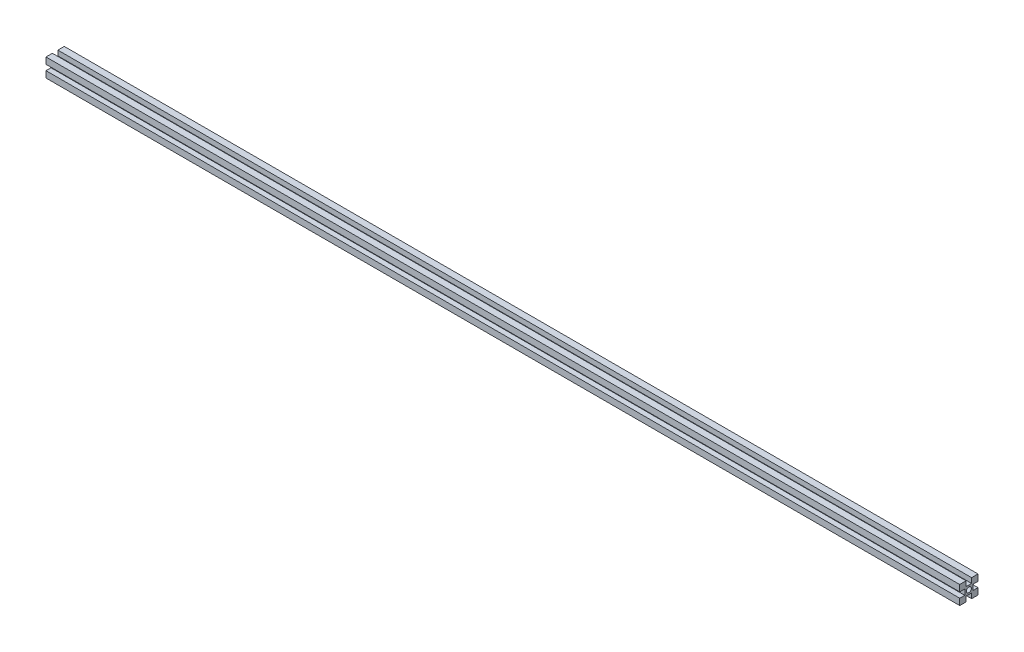
ISO-10303-21;
HEADER;
FILE_DESCRIPTION(('STEP AP214'),'2;1');
FILE_NAME('part.step','',(''),(''),'','','');
FILE_SCHEMA(('AUTOMOTIVE_DESIGN { 1 0 10303 214 1 1 1 1 }'));
ENDSEC;
DATA;
#1=APPLICATION_CONTEXT('core data for automotive mechanical design processes');
#2=APPLICATION_PROTOCOL_DEFINITION('international standard','automotive_design',2000,#1);
#3=PRODUCT_CONTEXT('',#1,'mechanical');
#4=PRODUCT('Part','Part','',(#3));
#5=PRODUCT_RELATED_PRODUCT_CATEGORY('part','',(#4));
#6=PRODUCT_DEFINITION_FORMATION('','',#4);
#7=PRODUCT_DEFINITION_CONTEXT('part definition',#1,'design');
#8=PRODUCT_DEFINITION('design','',#6,#7);
#9=PRODUCT_DEFINITION_SHAPE('','',#8);
#10=(LENGTH_UNIT() NAMED_UNIT(*) SI_UNIT(.MILLI.,.METRE.));
#11=(NAMED_UNIT(*) PLANE_ANGLE_UNIT() SI_UNIT($,.RADIAN.));
#12=(NAMED_UNIT(*) SI_UNIT($,.STERADIAN.) SOLID_ANGLE_UNIT());
#13=UNCERTAINTY_MEASURE_WITH_UNIT(LENGTH_MEASURE(1.E-05),#10,'distance_accuracy_value','');
#14=(GEOMETRIC_REPRESENTATION_CONTEXT(3) GLOBAL_UNCERTAINTY_ASSIGNED_CONTEXT((#13)) GLOBAL_UNIT_ASSIGNED_CONTEXT((#10,
#11,#12)) REPRESENTATION_CONTEXT('',''));
#15=CARTESIAN_POINT('',(0.,0.,0.));
#16=DIRECTION('',(0.,0.,1.));
#17=DIRECTION('',(1.,0.,0.));
#18=AXIS2_PLACEMENT_3D('',#15,#16,#17);
#19=CARTESIAN_POINT('',(0.,0.,0.));
#20=DIRECTION('',(1.,0.,0.));
#21=DIRECTION('',(0.,0.,-1.));
#22=AXIS2_PLACEMENT_3D('',#19,#20,#21);
#23=PLANE('',#22);
#24=DIRECTION('',(0.,0.,1.));
#25=VECTOR('',#24,1.);
#26=CARTESIAN_POINT('',(0.,3.,-10.));
#27=LINE('',#26,#25);
#28=CARTESIAN_POINT('',(0.,3.,-10.));
#29=VERTEX_POINT('',#28);
#30=CARTESIAN_POINT('',(0.,3.,-4.5));
#31=VERTEX_POINT('',#30);
#32=EDGE_CURVE('E9',#29,#31,#27,.T.);
#33=ORIENTED_EDGE('',*,*,#32,.T.);
#34=DIRECTION('',(0.,-1.,0.));
#35=VECTOR('',#34,1.);
#36=CARTESIAN_POINT('',(0.,3.,-4.5));
#37=LINE('',#36,#35);
#38=CARTESIAN_POINT('',(0.,-3.,-4.5));
#39=VERTEX_POINT('',#38);
#40=EDGE_CURVE('E224',#31,#39,#37,.T.);
#41=ORIENTED_EDGE('',*,*,#40,.T.);
#42=DIRECTION('',(0.,0.,-1.));
#43=VECTOR('',#42,1.);
#44=CARTESIAN_POINT('',(0.,-3.,-4.5));
#45=LINE('',#44,#43);
#46=CARTESIAN_POINT('',(0.,-3.,-10.));
#47=VERTEX_POINT('',#46);
#48=EDGE_CURVE('E208',#39,#47,#45,.T.);
#49=ORIENTED_EDGE('',*,*,#48,.T.);
#50=DIRECTION('',(0.,-1.,0.));
#51=VECTOR('',#50,1.);
#52=CARTESIAN_POINT('',(0.,-3.,-10.));
#53=LINE('',#52,#51);
#54=CARTESIAN_POINT('',(0.,-10.,-10.));
#55=VERTEX_POINT('',#54);
#56=EDGE_CURVE('E279',#47,#55,#53,.T.);
#57=ORIENTED_EDGE('',*,*,#56,.T.);
#58=DIRECTION('',(0.,0.,1.));
#59=VECTOR('',#58,1.);
#60=CARTESIAN_POINT('',(0.,-10.,-10.));
#61=LINE('',#60,#59);
#62=CARTESIAN_POINT('',(0.,-10.,-3.));
#63=VERTEX_POINT('',#62);
#64=EDGE_CURVE('E186',#55,#63,#61,.T.);
#65=ORIENTED_EDGE('',*,*,#64,.T.);
#66=DIRECTION('',(0.,1.,0.));
#67=VECTOR('',#66,1.);
#68=CARTESIAN_POINT('',(0.,-10.,-3.));
#69=LINE('',#68,#67);
#70=CARTESIAN_POINT('',(0.,-4.5,-3.));
#71=VERTEX_POINT('',#70);
#72=EDGE_CURVE('E194',#63,#71,#69,.T.);
#73=ORIENTED_EDGE('',*,*,#72,.T.);
#74=DIRECTION('',(0.,0.,1.));
#75=VECTOR('',#74,1.);
#76=CARTESIAN_POINT('',(0.,-4.5,-3.));
#77=LINE('',#76,#75);
#78=CARTESIAN_POINT('',(0.,-4.5,3.));
#79=VERTEX_POINT('',#78);
#80=EDGE_CURVE('E244',#71,#79,#77,.T.);
#81=ORIENTED_EDGE('',*,*,#80,.T.);
#82=DIRECTION('',(0.,-1.,0.));
#83=VECTOR('',#82,1.);
#84=CARTESIAN_POINT('',(0.,-4.5,3.));
#85=LINE('',#84,#83);
#86=CARTESIAN_POINT('',(0.,-10.,3.));
#87=VERTEX_POINT('',#86);
#88=EDGE_CURVE('E250',#79,#87,#85,.T.);
#89=ORIENTED_EDGE('',*,*,#88,.T.);
#90=DIRECTION('',(0.,0.,1.));
#91=VECTOR('',#90,1.);
#92=CARTESIAN_POINT('',(0.,-10.,3.));
#93=LINE('',#92,#91);
#94=CARTESIAN_POINT('',(0.,-10.,10.));
#95=VERTEX_POINT('',#94);
#96=EDGE_CURVE('E206',#87,#95,#93,.T.);
#97=ORIENTED_EDGE('',*,*,#96,.T.);
#98=DIRECTION('',(0.,1.,0.));
#99=VECTOR('',#98,1.);
#100=CARTESIAN_POINT('',(0.,-10.,10.));
#101=LINE('',#100,#99);
#102=CARTESIAN_POINT('',(0.,-3.,10.));
#103=VERTEX_POINT('',#102);
#104=EDGE_CURVE('E232',#95,#103,#101,.T.);
#105=ORIENTED_EDGE('',*,*,#104,.T.);
#106=DIRECTION('',(0.,0.,-1.));
#107=VECTOR('',#106,1.);
#108=CARTESIAN_POINT('',(0.,-3.,10.));
#109=LINE('',#108,#107);
#110=CARTESIAN_POINT('',(0.,-3.,4.5));
#111=VERTEX_POINT('',#110);
#112=EDGE_CURVE('E170',#103,#111,#109,.T.);
#113=ORIENTED_EDGE('',*,*,#112,.T.);
#114=DIRECTION('',(0.,1.,0.));
#115=VECTOR('',#114,1.);
#116=CARTESIAN_POINT('',(0.,-3.,4.5));
#117=LINE('',#116,#115);
#118=CARTESIAN_POINT('',(0.,3.,4.5));
#119=VERTEX_POINT('',#118);
#120=EDGE_CURVE('E156',#111,#119,#117,.T.);
#121=ORIENTED_EDGE('',*,*,#120,.T.);
#122=DIRECTION('',(0.,0.,1.));
#123=VECTOR('',#122,1.);
#124=CARTESIAN_POINT('',(0.,3.,4.5));
#125=LINE('',#124,#123);
#126=CARTESIAN_POINT('',(0.,3.,10.));
#127=VERTEX_POINT('',#126);
#128=EDGE_CURVE('E162',#119,#127,#125,.T.);
#129=ORIENTED_EDGE('',*,*,#128,.T.);
#130=DIRECTION('',(0.,1.,0.));
#131=VECTOR('',#130,1.);
#132=CARTESIAN_POINT('',(0.,3.,10.));
#133=LINE('',#132,#131);
#134=CARTESIAN_POINT('',(0.,10.,10.));
#135=VERTEX_POINT('',#134);
#136=EDGE_CURVE('E219',#127,#135,#133,.T.);
#137=ORIENTED_EDGE('',*,*,#136,.T.);
#138=DIRECTION('',(0.,0.,-1.));
#139=VECTOR('',#138,1.);
#140=CARTESIAN_POINT('',(0.,10.,10.));
#141=LINE('',#140,#139);
#142=CARTESIAN_POINT('',(0.,10.,3.));
#143=VERTEX_POINT('',#142);
#144=EDGE_CURVE('E273',#135,#143,#141,.T.);
#145=ORIENTED_EDGE('',*,*,#144,.T.);
#146=DIRECTION('',(0.,-1.,0.));
#147=VECTOR('',#146,1.);
#148=CARTESIAN_POINT('',(0.,10.,3.));
#149=LINE('',#148,#147);
#150=CARTESIAN_POINT('',(0.,4.5,3.));
#151=VERTEX_POINT('',#150);
#152=EDGE_CURVE('E181',#143,#151,#149,.T.);
#153=ORIENTED_EDGE('',*,*,#152,.T.);
#154=DIRECTION('',(0.,0.,-1.));
#155=VECTOR('',#154,1.);
#156=CARTESIAN_POINT('',(0.,4.5,3.));
#157=LINE('',#156,#155);
#158=CARTESIAN_POINT('',(0.,4.5,-3.));
#159=VERTEX_POINT('',#158);
#160=EDGE_CURVE('E268',#151,#159,#157,.T.);
#161=ORIENTED_EDGE('',*,*,#160,.T.);
#162=DIRECTION('',(0.,1.,0.));
#163=VECTOR('',#162,1.);
#164=CARTESIAN_POINT('',(0.,4.5,-3.));
#165=LINE('',#164,#163);
#166=CARTESIAN_POINT('',(0.,10.,-3.));
#167=VERTEX_POINT('',#166);
#168=EDGE_CURVE('E240',#159,#167,#165,.T.);
#169=ORIENTED_EDGE('',*,*,#168,.T.);
#170=DIRECTION('',(0.,0.,-1.));
#171=VECTOR('',#170,1.);
#172=CARTESIAN_POINT('',(0.,10.,-3.));
#173=LINE('',#172,#171);
#174=CARTESIAN_POINT('',(0.,10.,-10.));
#175=VERTEX_POINT('',#174);
#176=EDGE_CURVE('E263',#167,#175,#173,.T.);
#177=ORIENTED_EDGE('',*,*,#176,.T.);
#178=DIRECTION('',(0.,-1.,0.));
#179=VECTOR('',#178,1.);
#180=CARTESIAN_POINT('',(0.,10.,-10.));
#181=LINE('',#180,#179);
#182=EDGE_CURVE('E124',#175,#29,#181,.T.);
#183=ORIENTED_EDGE('',*,*,#182,.T.);
#184=EDGE_LOOP('',(#33,#41,#49,#57,#65,#73,#81,#89,#97,#105,#113,#121,#129,#137,#145,#153,#161,
#169,#177,#183));
#185=FACE_BOUND('',#184,.T.);
#186=CARTESIAN_POINT('',(0.,0.,0.));
#187=DIRECTION('',(1.,0.,0.));
#188=DIRECTION('',(0.,0.,-1.));
#189=AXIS2_PLACEMENT_3D('',#186,#187,#188);
#190=CIRCLE('',#189,2.75);
#191=CARTESIAN_POINT('',(0.,0.,-2.75));
#192=VERTEX_POINT('',#191);
#193=EDGE_CURVE('E193',#192,#192,#190,.T.);
#194=ORIENTED_EDGE('',*,*,#193,.T.);
#195=EDGE_LOOP('',(#194));
#196=FACE_BOUND('',#195,.T.);
#197=ADVANCED_FACE('F15',(#185,#196),#23,.F.);
#198=CARTESIAN_POINT('',(1000.,0.,0.));
#199=DIRECTION('',(1.,0.,0.));
#200=DIRECTION('',(0.,0.,-1.));
#201=AXIS2_PLACEMENT_3D('',#198,#199,#200);
#202=PLANE('',#201);
#203=DIRECTION('',(0.,-1.,0.));
#204=VECTOR('',#203,1.);
#205=CARTESIAN_POINT('',(1000.,3.,-4.49999999999994));
#206=LINE('',#205,#204);
#207=CARTESIAN_POINT('',(1000.,3.,-4.49999999999994));
#208=VERTEX_POINT('',#207);
#209=CARTESIAN_POINT('',(1000.,-3.,-4.49999999999994));
#210=VERTEX_POINT('',#209);
#211=EDGE_CURVE('E192',#208,#210,#206,.T.);
#212=ORIENTED_EDGE('',*,*,#211,.F.);
#213=DIRECTION('',(0.,0.,1.));
#214=VECTOR('',#213,1.);
#215=CARTESIAN_POINT('',(1000.,3.,-10.));
#216=LINE('',#215,#214);
#217=CARTESIAN_POINT('',(1000.,3.,-10.));
#218=VERTEX_POINT('',#217);
#219=EDGE_CURVE('E25',#218,#208,#216,.T.);
#220=ORIENTED_EDGE('',*,*,#219,.F.);
#221=DIRECTION('',(0.,-1.,0.));
#222=VECTOR('',#221,1.);
#223=CARTESIAN_POINT('',(1000.,10.,-10.));
#224=LINE('',#223,#222);
#225=CARTESIAN_POINT('',(1000.,10.,-10.));
#226=VERTEX_POINT('',#225);
#227=EDGE_CURVE('E131',#226,#218,#224,.T.);
#228=ORIENTED_EDGE('',*,*,#227,.F.);
#229=DIRECTION('',(0.,0.,-1.));
#230=VECTOR('',#229,1.);
#231=CARTESIAN_POINT('',(1000.,10.,-2.99999999999994));
#232=LINE('',#231,#230);
#233=CARTESIAN_POINT('',(1000.,10.,-2.99999999999994));
#234=VERTEX_POINT('',#233);
#235=EDGE_CURVE('E237',#234,#226,#232,.T.);
#236=ORIENTED_EDGE('',*,*,#235,.F.);
#237=DIRECTION('',(0.,1.,0.));
#238=VECTOR('',#237,1.);
#239=CARTESIAN_POINT('',(1000.,4.5,-2.99999999999994));
#240=LINE('',#239,#238);
#241=CARTESIAN_POINT('',(1000.,4.5,-2.99999999999994));
#242=VERTEX_POINT('',#241);
#243=EDGE_CURVE('E264',#242,#234,#240,.T.);
#244=ORIENTED_EDGE('',*,*,#243,.F.);
#245=DIRECTION('',(0.,0.,-1.));
#246=VECTOR('',#245,1.);
#247=CARTESIAN_POINT('',(1000.,4.5,3.00000000000006));
#248=LINE('',#247,#246);
#249=CARTESIAN_POINT('',(1000.,4.5,3.00000000000006));
#250=VERTEX_POINT('',#249);
#251=EDGE_CURVE('E177',#250,#242,#248,.T.);
#252=ORIENTED_EDGE('',*,*,#251,.F.);
#253=DIRECTION('',(0.,-1.,0.));
#254=VECTOR('',#253,1.);
#255=CARTESIAN_POINT('',(1000.,10.,3.00000000000006));
#256=LINE('',#255,#254);
#257=CARTESIAN_POINT('',(1000.,10.,3.00000000000006));
#258=VERTEX_POINT('',#257);
#259=EDGE_CURVE('E257',#258,#250,#256,.T.);
#260=ORIENTED_EDGE('',*,*,#259,.F.);
#261=DIRECTION('',(0.,0.,-1.));
#262=VECTOR('',#261,1.);
#263=CARTESIAN_POINT('',(1000.,10.,10.));
#264=LINE('',#263,#262);
#265=CARTESIAN_POINT('',(1000.,10.,10.));
#266=VERTEX_POINT('',#265);
#267=EDGE_CURVE('E233',#266,#258,#264,.T.);
#268=ORIENTED_EDGE('',*,*,#267,.F.);
#269=DIRECTION('',(0.,1.,0.));
#270=VECTOR('',#269,1.);
#271=CARTESIAN_POINT('',(1000.,3.,10.));
#272=LINE('',#271,#270);
#273=CARTESIAN_POINT('',(1000.,3.,10.));
#274=VERTEX_POINT('',#273);
#275=EDGE_CURVE('E151',#274,#266,#272,.T.);
#276=ORIENTED_EDGE('',*,*,#275,.F.);
#277=DIRECTION('',(0.,0.,1.));
#278=VECTOR('',#277,1.);
#279=CARTESIAN_POINT('',(1000.,3.,4.50000000000006));
#280=LINE('',#279,#278);
#281=CARTESIAN_POINT('',(1000.,3.,4.50000000000006));
#282=VERTEX_POINT('',#281);
#283=EDGE_CURVE('E140',#282,#274,#280,.T.);
#284=ORIENTED_EDGE('',*,*,#283,.F.);
#285=DIRECTION('',(0.,1.,0.));
#286=VECTOR('',#285,1.);
#287=CARTESIAN_POINT('',(1000.,-3.,4.50000000000006));
#288=LINE('',#287,#286);
#289=CARTESIAN_POINT('',(1000.,-3.,4.50000000000006));
#290=VERTEX_POINT('',#289);
#291=EDGE_CURVE('E147',#290,#282,#288,.T.);
#292=ORIENTED_EDGE('',*,*,#291,.F.);
#293=DIRECTION('',(0.,0.,-1.));
#294=VECTOR('',#293,1.);
#295=CARTESIAN_POINT('',(1000.,-3.,10.));
#296=LINE('',#295,#294);
#297=CARTESIAN_POINT('',(1000.,-3.,10.));
#298=VERTEX_POINT('',#297);
#299=EDGE_CURVE('E188',#298,#290,#296,.T.);
#300=ORIENTED_EDGE('',*,*,#299,.F.);
#301=DIRECTION('',(0.,1.,0.));
#302=VECTOR('',#301,1.);
#303=CARTESIAN_POINT('',(1000.,-10.,10.));
#304=LINE('',#303,#302);
#305=CARTESIAN_POINT('',(1000.,-10.,10.));
#306=VERTEX_POINT('',#305);
#307=EDGE_CURVE('E214',#306,#298,#304,.T.);
#308=ORIENTED_EDGE('',*,*,#307,.F.);
#309=DIRECTION('',(0.,0.,1.));
#310=VECTOR('',#309,1.);
#311=CARTESIAN_POINT('',(1000.,-10.,3.00000000000006));
#312=LINE('',#311,#310);
#313=CARTESIAN_POINT('',(1000.,-10.,3.00000000000006));
#314=VERTEX_POINT('',#313);
#315=EDGE_CURVE('E207',#314,#306,#312,.T.);
#316=ORIENTED_EDGE('',*,*,#315,.F.);
#317=DIRECTION('',(0.,-1.,0.));
#318=VECTOR('',#317,1.);
#319=CARTESIAN_POINT('',(1000.,-4.5,3.00000000000006));
#320=LINE('',#319,#318);
#321=CARTESIAN_POINT('',(1000.,-4.5,3.00000000000006));
#322=VERTEX_POINT('',#321);
#323=EDGE_CURVE('E247',#322,#314,#320,.T.);
#324=ORIENTED_EDGE('',*,*,#323,.F.);
#325=DIRECTION('',(0.,0.,1.));
#326=VECTOR('',#325,1.);
#327=CARTESIAN_POINT('',(1000.,-4.5,-2.99999999999994));
#328=LINE('',#327,#326);
#329=CARTESIAN_POINT('',(1000.,-4.5,-2.99999999999994));
#330=VERTEX_POINT('',#329);
#331=EDGE_CURVE('E197',#330,#322,#328,.T.);
#332=ORIENTED_EDGE('',*,*,#331,.F.);
#333=DIRECTION('',(0.,1.,0.));
#334=VECTOR('',#333,1.);
#335=CARTESIAN_POINT('',(1000.,-10.,-2.99999999999994));
#336=LINE('',#335,#334);
#337=CARTESIAN_POINT('',(1000.,-10.,-2.99999999999994));
#338=VERTEX_POINT('',#337);
#339=EDGE_CURVE('E182',#338,#330,#336,.T.);
#340=ORIENTED_EDGE('',*,*,#339,.F.);
#341=DIRECTION('',(0.,0.,1.));
#342=VECTOR('',#341,1.);
#343=CARTESIAN_POINT('',(1000.,-10.,-10.));
#344=LINE('',#343,#342);
#345=CARTESIAN_POINT('',(1000.,-10.,-10.));
#346=VERTEX_POINT('',#345);
#347=EDGE_CURVE('E282',#346,#338,#344,.T.);
#348=ORIENTED_EDGE('',*,*,#347,.F.);
#349=DIRECTION('',(0.,-1.,0.));
#350=VECTOR('',#349,1.);
#351=CARTESIAN_POINT('',(1000.,-3.,-10.));
#352=LINE('',#351,#350);
#353=CARTESIAN_POINT('',(1000.,-3.,-10.));
#354=VERTEX_POINT('',#353);
#355=EDGE_CURVE('E211',#354,#346,#352,.T.);
#356=ORIENTED_EDGE('',*,*,#355,.F.);
#357=DIRECTION('',(0.,0.,-1.));
#358=VECTOR('',#357,1.);
#359=CARTESIAN_POINT('',(1000.,-3.,-4.49999999999994));
#360=LINE('',#359,#358);
#361=EDGE_CURVE('E253',#210,#354,#360,.T.);
#362=ORIENTED_EDGE('',*,*,#361,.F.);
#363=EDGE_LOOP('',(#212,#220,#228,#236,#244,#252,#260,#268,#276,#284,#292,#300,#308,#316,#324,
#332,#340,#348,#356,#362));
#364=FACE_BOUND('',#363,.T.);
#365=CARTESIAN_POINT('',(1000.,0.,0.));
#366=DIRECTION('',(-1.,0.,0.));
#367=DIRECTION('',(0.,0.,-1.));
#368=AXIS2_PLACEMENT_3D('',#365,#366,#367);
#369=CIRCLE('',#368,2.75);
#370=CARTESIAN_POINT('',(1000.,0.,-2.74999999999994));
#371=VERTEX_POINT('',#370);
#372=EDGE_CURVE('E189',#371,#371,#369,.T.);
#373=ORIENTED_EDGE('',*,*,#372,.T.);
#374=EDGE_LOOP('',(#373));
#375=FACE_BOUND('',#374,.T.);
#376=ADVANCED_FACE('F143',(#364,#375),#202,.T.);
#377=CARTESIAN_POINT('',(0.,3.,-7.25));
#378=DIRECTION('',(0.,-1.,0.));
#379=DIRECTION('',(0.,0.,-1.));
#380=AXIS2_PLACEMENT_3D('',#377,#378,#379);
#381=PLANE('',#380);
#382=ORIENTED_EDGE('',*,*,#219,.T.);
#383=DIRECTION('',(1.,0.,0.));
#384=VECTOR('',#383,1.);
#385=CARTESIAN_POINT('',(0.,3.,-4.5));
#386=LINE('',#385,#384);
#387=EDGE_CURVE('E227',#31,#208,#386,.T.);
#388=ORIENTED_EDGE('',*,*,#387,.F.);
#389=ORIENTED_EDGE('',*,*,#32,.F.);
#390=DIRECTION('',(1.,0.,0.));
#391=VECTOR('',#390,1.);
#392=CARTESIAN_POINT('',(0.,3.,-10.));
#393=LINE('',#392,#391);
#394=EDGE_CURVE('E201',#29,#218,#393,.T.);
#395=ORIENTED_EDGE('',*,*,#394,.T.);
#396=EDGE_LOOP('',(#382,#388,#389,#395));
#397=FACE_BOUND('',#396,.T.);
#398=ADVANCED_FACE('F344',(#397),#381,.T.);
#399=CARTESIAN_POINT('',(0.,6.5,-10.));
#400=DIRECTION('',(0.,0.,-1.));
#401=DIRECTION('',(0.,1.,0.));
#402=AXIS2_PLACEMENT_3D('',#399,#400,#401);
#403=PLANE('',#402);
#404=ORIENTED_EDGE('',*,*,#227,.T.);
#405=ORIENTED_EDGE('',*,*,#394,.F.);
#406=ORIENTED_EDGE('',*,*,#182,.F.);
#407=DIRECTION('',(1.,0.,0.));
#408=VECTOR('',#407,1.);
#409=CARTESIAN_POINT('',(0.,10.,-10.));
#410=LINE('',#409,#408);
#411=EDGE_CURVE('E239',#175,#226,#410,.T.);
#412=ORIENTED_EDGE('',*,*,#411,.T.);
#413=EDGE_LOOP('',(#404,#405,#406,#412));
#414=FACE_BOUND('',#413,.T.);
#415=ADVANCED_FACE('F343',(#414),#403,.T.);
#416=CARTESIAN_POINT('',(0.,10.,-6.5));
#417=DIRECTION('',(0.,1.,0.));
#418=DIRECTION('',(0.,0.,1.));
#419=AXIS2_PLACEMENT_3D('',#416,#417,#418);
#420=PLANE('',#419);
#421=ORIENTED_EDGE('',*,*,#235,.T.);
#422=ORIENTED_EDGE('',*,*,#411,.F.);
#423=ORIENTED_EDGE('',*,*,#176,.F.);
#424=DIRECTION('',(1.,0.,0.));
#425=VECTOR('',#424,1.);
#426=CARTESIAN_POINT('',(0.,10.,-3.));
#427=LINE('',#426,#425);
#428=EDGE_CURVE('E267',#167,#234,#427,.T.);
#429=ORIENTED_EDGE('',*,*,#428,.T.);
#430=EDGE_LOOP('',(#421,#422,#423,#429));
#431=FACE_BOUND('',#430,.T.);
#432=ADVANCED_FACE('F342',(#431),#420,.T.);
#433=CARTESIAN_POINT('',(0.,7.25,-3.));
#434=DIRECTION('',(0.,0.,1.));
#435=DIRECTION('',(0.,-1.,0.));
#436=AXIS2_PLACEMENT_3D('',#433,#434,#435);
#437=PLANE('',#436);
#438=ORIENTED_EDGE('',*,*,#243,.T.);
#439=ORIENTED_EDGE('',*,*,#428,.F.);
#440=ORIENTED_EDGE('',*,*,#168,.F.);
#441=DIRECTION('',(1.,0.,0.));
#442=VECTOR('',#441,1.);
#443=CARTESIAN_POINT('',(0.,4.5,-3.));
#444=LINE('',#443,#442);
#445=EDGE_CURVE('E180',#159,#242,#444,.T.);
#446=ORIENTED_EDGE('',*,*,#445,.T.);
#447=EDGE_LOOP('',(#438,#439,#440,#446));
#448=FACE_BOUND('',#447,.T.);
#449=ADVANCED_FACE('F338',(#448),#437,.T.);
#450=CARTESIAN_POINT('',(0.,4.5,0.));
#451=DIRECTION('',(0.,1.,0.));
#452=DIRECTION('',(0.,0.,1.));
#453=AXIS2_PLACEMENT_3D('',#450,#451,#452);
#454=PLANE('',#453);
#455=ORIENTED_EDGE('',*,*,#251,.T.);
#456=ORIENTED_EDGE('',*,*,#445,.F.);
#457=ORIENTED_EDGE('',*,*,#160,.F.);
#458=DIRECTION('',(1.,0.,0.));
#459=VECTOR('',#458,1.);
#460=CARTESIAN_POINT('',(0.,4.5,3.));
#461=LINE('',#460,#459);
#462=EDGE_CURVE('E254',#151,#250,#461,.T.);
#463=ORIENTED_EDGE('',*,*,#462,.T.);
#464=EDGE_LOOP('',(#455,#456,#457,#463));
#465=FACE_BOUND('',#464,.T.);
#466=ADVANCED_FACE('F336',(#465),#454,.T.);
#467=CARTESIAN_POINT('',(0.,7.25,3.));
#468=DIRECTION('',(0.,0.,-1.));
#469=DIRECTION('',(0.,1.,0.));
#470=AXIS2_PLACEMENT_3D('',#467,#468,#469);
#471=PLANE('',#470);
#472=ORIENTED_EDGE('',*,*,#259,.T.);
#473=ORIENTED_EDGE('',*,*,#462,.F.);
#474=ORIENTED_EDGE('',*,*,#152,.F.);
#475=DIRECTION('',(1.,0.,0.));
#476=VECTOR('',#475,1.);
#477=CARTESIAN_POINT('',(0.,10.,3.));
#478=LINE('',#477,#476);
#479=EDGE_CURVE('E236',#143,#258,#478,.T.);
#480=ORIENTED_EDGE('',*,*,#479,.T.);
#481=EDGE_LOOP('',(#472,#473,#474,#480));
#482=FACE_BOUND('',#481,.T.);
#483=ADVANCED_FACE('F331',(#482),#471,.T.);
#484=CARTESIAN_POINT('',(0.,10.,6.5));
#485=DIRECTION('',(0.,1.,0.));
#486=DIRECTION('',(0.,0.,1.));
#487=AXIS2_PLACEMENT_3D('',#484,#485,#486);
#488=PLANE('',#487);
#489=ORIENTED_EDGE('',*,*,#267,.T.);
#490=ORIENTED_EDGE('',*,*,#479,.F.);
#491=ORIENTED_EDGE('',*,*,#144,.F.);
#492=DIRECTION('',(1.,0.,0.));
#493=VECTOR('',#492,1.);
#494=CARTESIAN_POINT('',(0.,10.,10.));
#495=LINE('',#494,#493);
#496=EDGE_CURVE('E216',#135,#266,#495,.T.);
#497=ORIENTED_EDGE('',*,*,#496,.T.);
#498=EDGE_LOOP('',(#489,#490,#491,#497));
#499=FACE_BOUND('',#498,.T.);
#500=ADVANCED_FACE('F326',(#499),#488,.T.);
#501=CARTESIAN_POINT('',(0.,6.5,10.));
#502=DIRECTION('',(0.,0.,1.));
#503=DIRECTION('',(0.,-1.,0.));
#504=AXIS2_PLACEMENT_3D('',#501,#502,#503);
#505=PLANE('',#504);
#506=ORIENTED_EDGE('',*,*,#275,.T.);
#507=ORIENTED_EDGE('',*,*,#496,.F.);
#508=ORIENTED_EDGE('',*,*,#136,.F.);
#509=DIRECTION('',(1.,0.,0.));
#510=VECTOR('',#509,1.);
#511=CARTESIAN_POINT('',(0.,3.,10.));
#512=LINE('',#511,#510);
#513=EDGE_CURVE('E155',#127,#274,#512,.T.);
#514=ORIENTED_EDGE('',*,*,#513,.T.);
#515=EDGE_LOOP('',(#506,#507,#508,#514));
#516=FACE_BOUND('',#515,.T.);
#517=ADVANCED_FACE('F324',(#516),#505,.T.);
#518=CARTESIAN_POINT('',(0.,3.,7.25));
#519=DIRECTION('',(0.,-1.,0.));
#520=DIRECTION('',(0.,0.,-1.));
#521=AXIS2_PLACEMENT_3D('',#518,#519,#520);
#522=PLANE('',#521);
#523=ORIENTED_EDGE('',*,*,#283,.T.);
#524=ORIENTED_EDGE('',*,*,#513,.F.);
#525=ORIENTED_EDGE('',*,*,#128,.F.);
#526=DIRECTION('',(1.,0.,0.));
#527=VECTOR('',#526,1.);
#528=CARTESIAN_POINT('',(0.,3.,4.5));
#529=LINE('',#528,#527);
#530=EDGE_CURVE('E159',#119,#282,#529,.T.);
#531=ORIENTED_EDGE('',*,*,#530,.T.);
#532=EDGE_LOOP('',(#523,#524,#525,#531));
#533=FACE_BOUND('',#532,.T.);
#534=ADVANCED_FACE('F160',(#533),#522,.T.);
#535=CARTESIAN_POINT('',(0.,0.,4.5));
#536=DIRECTION('',(0.,0.,1.));
#537=DIRECTION('',(0.,-1.,0.));
#538=AXIS2_PLACEMENT_3D('',#535,#536,#537);
#539=PLANE('',#538);
#540=ORIENTED_EDGE('',*,*,#291,.T.);
#541=ORIENTED_EDGE('',*,*,#530,.F.);
#542=ORIENTED_EDGE('',*,*,#120,.F.);
#543=DIRECTION('',(1.,0.,0.));
#544=VECTOR('',#543,1.);
#545=CARTESIAN_POINT('',(0.,-3.,4.5));
#546=LINE('',#545,#544);
#547=EDGE_CURVE('E168',#111,#290,#546,.T.);
#548=ORIENTED_EDGE('',*,*,#547,.T.);
#549=EDGE_LOOP('',(#540,#541,#542,#548));
#550=FACE_BOUND('',#549,.T.);
#551=ADVANCED_FACE('F166',(#550),#539,.T.);
#552=CARTESIAN_POINT('',(0.,-3.,7.25));
#553=DIRECTION('',(0.,1.,0.));
#554=DIRECTION('',(0.,0.,1.));
#555=AXIS2_PLACEMENT_3D('',#552,#553,#554);
#556=PLANE('',#555);
#557=ORIENTED_EDGE('',*,*,#299,.T.);
#558=ORIENTED_EDGE('',*,*,#547,.F.);
#559=ORIENTED_EDGE('',*,*,#112,.F.);
#560=DIRECTION('',(1.,0.,0.));
#561=VECTOR('',#560,1.);
#562=CARTESIAN_POINT('',(0.,-3.,10.));
#563=LINE('',#562,#561);
#564=EDGE_CURVE('E271',#103,#298,#563,.T.);
#565=ORIENTED_EDGE('',*,*,#564,.T.);
#566=EDGE_LOOP('',(#557,#558,#559,#565));
#567=FACE_BOUND('',#566,.T.);
#568=ADVANCED_FACE('F381',(#567),#556,.T.);
#569=CARTESIAN_POINT('',(0.,-6.5,10.));
#570=DIRECTION('',(0.,0.,1.));
#571=DIRECTION('',(0.,-1.,0.));
#572=AXIS2_PLACEMENT_3D('',#569,#570,#571);
#573=PLANE('',#572);
#574=ORIENTED_EDGE('',*,*,#307,.T.);
#575=ORIENTED_EDGE('',*,*,#564,.F.);
#576=ORIENTED_EDGE('',*,*,#104,.F.);
#577=DIRECTION('',(1.,0.,0.));
#578=VECTOR('',#577,1.);
#579=CARTESIAN_POINT('',(0.,-10.,10.));
#580=LINE('',#579,#578);
#581=EDGE_CURVE('E203',#95,#306,#580,.T.);
#582=ORIENTED_EDGE('',*,*,#581,.T.);
#583=EDGE_LOOP('',(#574,#575,#576,#582));
#584=FACE_BOUND('',#583,.T.);
#585=ADVANCED_FACE('F17',(#584),#573,.T.);
#586=CARTESIAN_POINT('',(0.,-10.,6.5));
#587=DIRECTION('',(0.,-1.,0.));
#588=DIRECTION('',(0.,0.,-1.));
#589=AXIS2_PLACEMENT_3D('',#586,#587,#588);
#590=PLANE('',#589);
#591=ORIENTED_EDGE('',*,*,#315,.T.);
#592=ORIENTED_EDGE('',*,*,#581,.F.);
#593=ORIENTED_EDGE('',*,*,#96,.F.);
#594=DIRECTION('',(1.,0.,0.));
#595=VECTOR('',#594,1.);
#596=CARTESIAN_POINT('',(0.,-10.,3.));
#597=LINE('',#596,#595);
#598=EDGE_CURVE('E19',#87,#314,#597,.T.);
#599=ORIENTED_EDGE('',*,*,#598,.T.);
#600=EDGE_LOOP('',(#591,#592,#593,#599));
#601=FACE_BOUND('',#600,.T.);
#602=ADVANCED_FACE('F372',(#601),#590,.T.);
#603=CARTESIAN_POINT('',(0.,-7.25,3.));
#604=DIRECTION('',(0.,0.,-1.));
#605=DIRECTION('',(0.,1.,0.));
#606=AXIS2_PLACEMENT_3D('',#603,#604,#605);
#607=PLANE('',#606);
#608=ORIENTED_EDGE('',*,*,#323,.T.);
#609=ORIENTED_EDGE('',*,*,#598,.F.);
#610=ORIENTED_EDGE('',*,*,#88,.F.);
#611=DIRECTION('',(1.,0.,0.));
#612=VECTOR('',#611,1.);
#613=CARTESIAN_POINT('',(0.,-4.5,3.));
#614=LINE('',#613,#612);
#615=EDGE_CURVE('E200',#79,#322,#614,.T.);
#616=ORIENTED_EDGE('',*,*,#615,.T.);
#617=EDGE_LOOP('',(#608,#609,#610,#616));
#618=FACE_BOUND('',#617,.T.);
#619=ADVANCED_FACE('F376',(#618),#607,.T.);
#620=CARTESIAN_POINT('',(0.,-4.5,0.));
#621=DIRECTION('',(0.,-1.,0.));
#622=DIRECTION('',(0.,0.,-1.));
#623=AXIS2_PLACEMENT_3D('',#620,#621,#622);
#624=PLANE('',#623);
#625=ORIENTED_EDGE('',*,*,#331,.T.);
#626=ORIENTED_EDGE('',*,*,#615,.F.);
#627=ORIENTED_EDGE('',*,*,#80,.F.);
#628=DIRECTION('',(1.,0.,0.));
#629=VECTOR('',#628,1.);
#630=CARTESIAN_POINT('',(0.,-4.5,-3.));
#631=LINE('',#630,#629);
#632=EDGE_CURVE('E185',#71,#330,#631,.T.);
#633=ORIENTED_EDGE('',*,*,#632,.T.);
#634=EDGE_LOOP('',(#625,#626,#627,#633));
#635=FACE_BOUND('',#634,.T.);
#636=ADVANCED_FACE('F425',(#635),#624,.T.);
#637=CARTESIAN_POINT('',(0.,-7.25,-3.));
#638=DIRECTION('',(0.,0.,1.));
#639=DIRECTION('',(0.,-1.,0.));
#640=AXIS2_PLACEMENT_3D('',#637,#638,#639);
#641=PLANE('',#640);
#642=ORIENTED_EDGE('',*,*,#339,.T.);
#643=ORIENTED_EDGE('',*,*,#632,.F.);
#644=ORIENTED_EDGE('',*,*,#72,.F.);
#645=DIRECTION('',(1.,0.,0.));
#646=VECTOR('',#645,1.);
#647=CARTESIAN_POINT('',(0.,-10.,-3.));
#648=LINE('',#647,#646);
#649=EDGE_CURVE('E223',#63,#338,#648,.T.);
#650=ORIENTED_EDGE('',*,*,#649,.T.);
#651=EDGE_LOOP('',(#642,#643,#644,#650));
#652=FACE_BOUND('',#651,.T.);
#653=ADVANCED_FACE('F410',(#652),#641,.T.);
#654=CARTESIAN_POINT('',(0.,-10.,-6.5));
#655=DIRECTION('',(0.,-1.,0.));
#656=DIRECTION('',(0.,0.,-1.));
#657=AXIS2_PLACEMENT_3D('',#654,#655,#656);
#658=PLANE('',#657);
#659=ORIENTED_EDGE('',*,*,#347,.T.);
#660=ORIENTED_EDGE('',*,*,#649,.F.);
#661=ORIENTED_EDGE('',*,*,#64,.F.);
#662=DIRECTION('',(1.,0.,0.));
#663=VECTOR('',#662,1.);
#664=CARTESIAN_POINT('',(0.,-10.,-10.));
#665=LINE('',#664,#663);
#666=EDGE_CURVE('E283',#55,#346,#665,.T.);
#667=ORIENTED_EDGE('',*,*,#666,.T.);
#668=EDGE_LOOP('',(#659,#660,#661,#667));
#669=FACE_BOUND('',#668,.T.);
#670=ADVANCED_FACE('F406',(#669),#658,.T.);
#671=CARTESIAN_POINT('',(0.,-6.5,-10.));
#672=DIRECTION('',(0.,0.,-1.));
#673=DIRECTION('',(0.,1.,0.));
#674=AXIS2_PLACEMENT_3D('',#671,#672,#673);
#675=PLANE('',#674);
#676=ORIENTED_EDGE('',*,*,#355,.T.);
#677=ORIENTED_EDGE('',*,*,#666,.F.);
#678=ORIENTED_EDGE('',*,*,#56,.F.);
#679=DIRECTION('',(1.,0.,0.));
#680=VECTOR('',#679,1.);
#681=CARTESIAN_POINT('',(0.,-3.,-10.));
#682=LINE('',#681,#680);
#683=EDGE_CURVE('E212',#47,#354,#682,.T.);
#684=ORIENTED_EDGE('',*,*,#683,.T.);
#685=EDGE_LOOP('',(#676,#677,#678,#684));
#686=FACE_BOUND('',#685,.T.);
#687=ADVANCED_FACE('F409',(#686),#675,.T.);
#688=CARTESIAN_POINT('',(0.,-3.,-7.25));
#689=DIRECTION('',(0.,1.,0.));
#690=DIRECTION('',(0.,0.,1.));
#691=AXIS2_PLACEMENT_3D('',#688,#689,#690);
#692=PLANE('',#691);
#693=ORIENTED_EDGE('',*,*,#361,.T.);
#694=ORIENTED_EDGE('',*,*,#683,.F.);
#695=ORIENTED_EDGE('',*,*,#48,.F.);
#696=DIRECTION('',(1.,0.,0.));
#697=VECTOR('',#696,1.);
#698=CARTESIAN_POINT('',(0.,-3.,-4.5));
#699=LINE('',#698,#697);
#700=EDGE_CURVE('E228',#39,#210,#699,.T.);
#701=ORIENTED_EDGE('',*,*,#700,.T.);
#702=EDGE_LOOP('',(#693,#694,#695,#701));
#703=FACE_BOUND('',#702,.T.);
#704=ADVANCED_FACE('F356',(#703),#692,.T.);
#705=CARTESIAN_POINT('',(0.,0.,-4.5));
#706=DIRECTION('',(0.,0.,-1.));
#707=DIRECTION('',(0.,1.,0.));
#708=AXIS2_PLACEMENT_3D('',#705,#706,#707);
#709=PLANE('',#708);
#710=ORIENTED_EDGE('',*,*,#211,.T.);
#711=ORIENTED_EDGE('',*,*,#700,.F.);
#712=ORIENTED_EDGE('',*,*,#40,.F.);
#713=ORIENTED_EDGE('',*,*,#387,.T.);
#714=EDGE_LOOP('',(#710,#711,#712,#713));
#715=FACE_BOUND('',#714,.T.);
#716=ADVANCED_FACE('F347',(#715),#709,.T.);
#717=CARTESIAN_POINT('',(500.,0.,0.));
#718=DIRECTION('',(-1.,0.,0.));
#719=DIRECTION('',(0.,0.,-1.));
#720=AXIS2_PLACEMENT_3D('',#717,#718,#719);
#721=CYLINDRICAL_SURFACE('',#720,2.75);
#722=ORIENTED_EDGE('',*,*,#372,.F.);
#723=EDGE_LOOP('',(#722));
#724=FACE_BOUND('',#723,.T.);
#725=ORIENTED_EDGE('',*,*,#193,.F.);
#726=EDGE_LOOP('',(#725));
#727=FACE_BOUND('',#726,.T.);
#728=ADVANCED_FACE('F386',(#724,#727),#721,.F.);
#729=CLOSED_SHELL('',(#197,#376,#398,#415,#432,#449,#466,#483,#500,#517,#534,#551,#568,#585,
#602,#619,#636,#653,#670,#687,#704,#716,#728));
#730=MANIFOLD_SOLID_BREP('B1',#729);
#731=ADVANCED_BREP_SHAPE_REPRESENTATION('',(#18,#730),#14);
#732=SHAPE_DEFINITION_REPRESENTATION(#9,#731);
ENDSEC;
END-ISO-10303-21;
